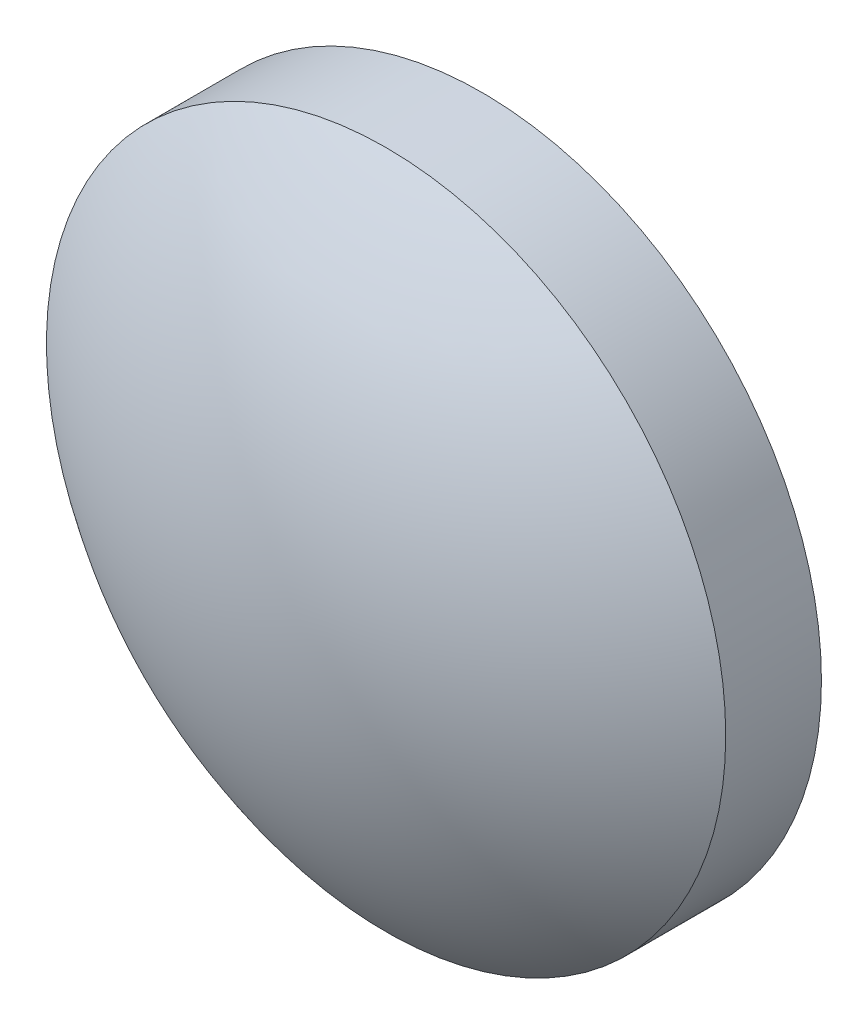
ISO-10303-21;
HEADER;
FILE_DESCRIPTION(('STEP AP214'),'2;1');
FILE_NAME('part.step','',(''),(''),'','','');
FILE_SCHEMA(('AUTOMOTIVE_DESIGN { 1 0 10303 214 1 1 1 1 }'));
ENDSEC;
DATA;
#1=APPLICATION_CONTEXT('core data for automotive mechanical design processes');
#2=APPLICATION_PROTOCOL_DEFINITION('international standard','automotive_design',2000,#1);
#3=PRODUCT_CONTEXT('',#1,'mechanical');
#4=PRODUCT('Part','Part','',(#3));
#5=PRODUCT_RELATED_PRODUCT_CATEGORY('part','',(#4));
#6=PRODUCT_DEFINITION_FORMATION('','',#4);
#7=PRODUCT_DEFINITION_CONTEXT('part definition',#1,'design');
#8=PRODUCT_DEFINITION('design','',#6,#7);
#9=PRODUCT_DEFINITION_SHAPE('','',#8);
#10=(LENGTH_UNIT() NAMED_UNIT(*) SI_UNIT(.MILLI.,.METRE.));
#11=(NAMED_UNIT(*) PLANE_ANGLE_UNIT() SI_UNIT($,.RADIAN.));
#12=(NAMED_UNIT(*) SI_UNIT($,.STERADIAN.) SOLID_ANGLE_UNIT());
#13=UNCERTAINTY_MEASURE_WITH_UNIT(LENGTH_MEASURE(1.E-05),#10,'distance_accuracy_value','');
#14=(GEOMETRIC_REPRESENTATION_CONTEXT(3) GLOBAL_UNCERTAINTY_ASSIGNED_CONTEXT((#13)) GLOBAL_UNIT_ASSIGNED_CONTEXT((#10,
#11,#12)) REPRESENTATION_CONTEXT('',''));
#15=CARTESIAN_POINT('',(0.,0.,0.));
#16=DIRECTION('',(0.,0.,1.));
#17=DIRECTION('',(1.,0.,0.));
#18=AXIS2_PLACEMENT_3D('',#15,#16,#17);
#19=CARTESIAN_POINT('',(0.,0.,-8.31));
#20=DIRECTION('',(0.,0.,1.));
#21=DIRECTION('',(0.,1.,0.));
#22=AXIS2_PLACEMENT_3D('',#19,#20,#21);
#23=SPHERICAL_SURFACE('',#22,10.3);
#24=CARTESIAN_POINT('',(0.,0.,-0.200283605452037));
#25=DIRECTION('',(0.,0.,1.));
#26=DIRECTION('',(1.,0.,0.));
#27=AXIS2_PLACEMENT_3D('',#24,#25,#26);
#28=CIRCLE('',#27,6.35);
#29=CARTESIAN_POINT('',(6.35,0.,-0.200283605452037));
#30=VERTEX_POINT('',#29);
#31=EDGE_CURVE('E8',#30,#30,#28,.T.);
#32=ORIENTED_EDGE('',*,*,#31,.T.);
#33=EDGE_LOOP('',(#32));
#34=FACE_BOUND('',#33,.T.);
#35=ADVANCED_FACE('F12',(#34),#23,.T.);
#36=CARTESIAN_POINT('',(0.,0.,4.30813204540037));
#37=DIRECTION('',(0.,0.,1.));
#38=DIRECTION('',(1.,0.,0.));
#39=AXIS2_PLACEMENT_3D('',#36,#37,#38);
#40=CYLINDRICAL_SURFACE('',#39,6.35);
#41=ORIENTED_EDGE('',*,*,#31,.F.);
#42=EDGE_LOOP('',(#41));
#43=FACE_BOUND('',#42,.T.);
#44=CARTESIAN_POINT('',(0.,0.,-1.99));
#45=DIRECTION('',(0.,0.,1.));
#46=DIRECTION('',(1.,0.,0.));
#47=AXIS2_PLACEMENT_3D('',#44,#45,#46);
#48=CIRCLE('',#47,6.35);
#49=CARTESIAN_POINT('',(6.35,0.,-1.99));
#50=VERTEX_POINT('',#49);
#51=EDGE_CURVE('E18',#50,#50,#48,.T.);
#52=ORIENTED_EDGE('',*,*,#51,.T.);
#53=EDGE_LOOP('',(#52));
#54=FACE_BOUND('',#53,.T.);
#55=ADVANCED_FACE('F24',(#43,#54),#40,.T.);
#56=CARTESIAN_POINT('',(0.,0.,-1.99));
#57=DIRECTION('',(0.,0.,1.));
#58=DIRECTION('',(1.,0.,0.));
#59=AXIS2_PLACEMENT_3D('',#56,#57,#58);
#60=PLANE('',#59);
#61=ORIENTED_EDGE('',*,*,#51,.F.);
#62=EDGE_LOOP('',(#61));
#63=FACE_BOUND('',#62,.T.);
#64=ADVANCED_FACE('F26',(#63),#60,.F.);
#65=CLOSED_SHELL('',(#35,#55,#64));
#66=MANIFOLD_SOLID_BREP('B1',#65);
#67=ADVANCED_BREP_SHAPE_REPRESENTATION('',(#18,#66),#14);
#68=SHAPE_DEFINITION_REPRESENTATION(#9,#67);
ENDSEC;
END-ISO-10303-21;
